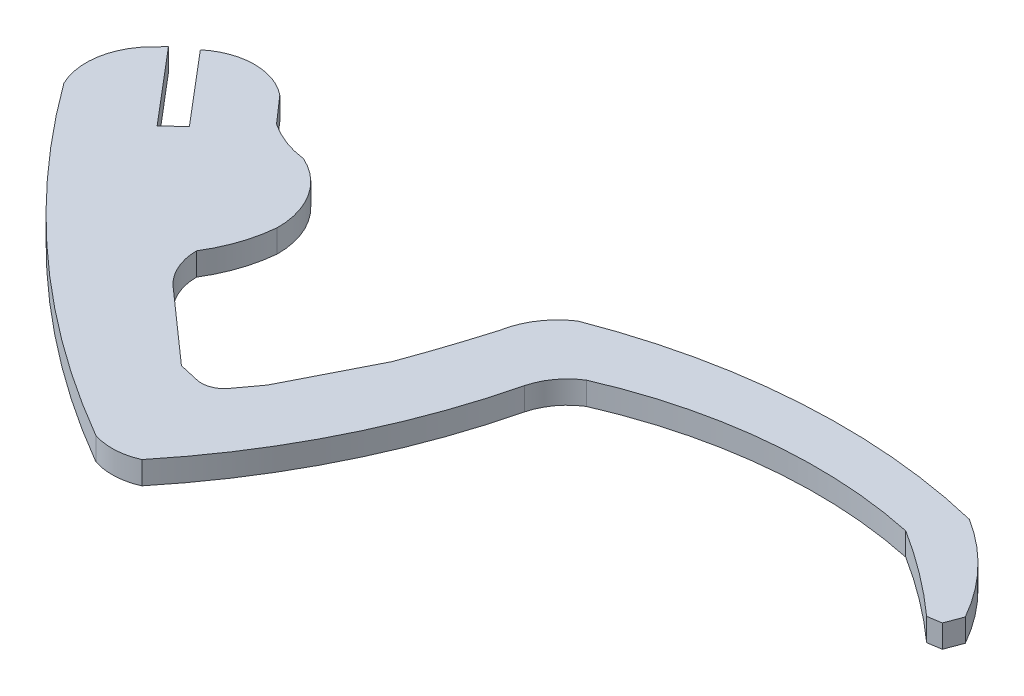
ISO-10303-21;
HEADER;
FILE_DESCRIPTION(('STEP AP214'),'2;1');
FILE_NAME('part.step','',(''),(''),'','','');
FILE_SCHEMA(('AUTOMOTIVE_DESIGN { 1 0 10303 214 1 1 1 1 }'));
ENDSEC;
DATA;
#1=APPLICATION_CONTEXT('core data for automotive mechanical design processes');
#2=APPLICATION_PROTOCOL_DEFINITION('international standard','automotive_design',2000,#1);
#3=PRODUCT_CONTEXT('',#1,'mechanical');
#4=PRODUCT('Part','Part','',(#3));
#5=PRODUCT_RELATED_PRODUCT_CATEGORY('part','',(#4));
#6=PRODUCT_DEFINITION_FORMATION('','',#4);
#7=PRODUCT_DEFINITION_CONTEXT('part definition',#1,'design');
#8=PRODUCT_DEFINITION('design','',#6,#7);
#9=PRODUCT_DEFINITION_SHAPE('','',#8);
#10=(LENGTH_UNIT() NAMED_UNIT(*) SI_UNIT(.MILLI.,.METRE.));
#11=(NAMED_UNIT(*) PLANE_ANGLE_UNIT() SI_UNIT($,.RADIAN.));
#12=(NAMED_UNIT(*) SI_UNIT($,.STERADIAN.) SOLID_ANGLE_UNIT());
#13=UNCERTAINTY_MEASURE_WITH_UNIT(LENGTH_MEASURE(1.E-05),#10,'distance_accuracy_value','');
#14=(GEOMETRIC_REPRESENTATION_CONTEXT(3) GLOBAL_UNCERTAINTY_ASSIGNED_CONTEXT((#13)) GLOBAL_UNIT_ASSIGNED_CONTEXT((#10,
#11,#12)) REPRESENTATION_CONTEXT('',''));
#15=CARTESIAN_POINT('',(0.,0.,0.));
#16=DIRECTION('',(0.,0.,1.));
#17=DIRECTION('',(1.,0.,0.));
#18=AXIS2_PLACEMENT_3D('',#15,#16,#17);
#19=CARTESIAN_POINT('',(-400.996253466817,2.,-450.233849998404));
#20=DIRECTION('',(0.715544191680959,0.,0.698567469720458));
#21=DIRECTION('',(0.698567469720458,0.,-0.715544191680959));
#22=AXIS2_PLACEMENT_3D('',#19,#20,#21);
#23=PLANE('',#22);
#24=DIRECTION('',(-0.698567469720458,0.,0.715544191680959));
#25=VECTOR('',#24,1.);
#26=CARTESIAN_POINT('',(-400.996253466817,0.,-450.233849998404));
#27=LINE('',#26,#25);
#28=CARTESIAN_POINT('',(-289.75829,0.,-564.17514));
#29=VERTEX_POINT('',#28);
#30=CARTESIAN_POINT('',(-290.48127,0.,-563.43459));
#31=VERTEX_POINT('',#30);
#32=EDGE_CURVE('E11',#29,#31,#27,.T.);
#33=ORIENTED_EDGE('',*,*,#32,.T.);
#34=DIRECTION('',(0.,-1.,0.));
#35=VECTOR('',#34,1.);
#36=CARTESIAN_POINT('',(-290.48127,2.,-563.43459));
#37=LINE('',#36,#35);
#38=CARTESIAN_POINT('',(-290.48127,2.,-563.43459));
#39=VERTEX_POINT('',#38);
#40=EDGE_CURVE('E780',#39,#31,#37,.T.);
#41=ORIENTED_EDGE('',*,*,#40,.F.);
#42=DIRECTION('',(-0.698567469720458,0.,0.715544191680959));
#43=VECTOR('',#42,1.);
#44=CARTESIAN_POINT('',(-400.996253466817,2.,-450.233849998404));
#45=LINE('',#44,#43);
#46=CARTESIAN_POINT('',(-289.75829,2.,-564.17514));
#47=VERTEX_POINT('',#46);
#48=EDGE_CURVE('E41',#47,#39,#45,.T.);
#49=ORIENTED_EDGE('',*,*,#48,.F.);
#50=DIRECTION('',(0.,-1.,0.));
#51=VECTOR('',#50,1.);
#52=CARTESIAN_POINT('',(-289.75829,2.,-564.17514));
#53=LINE('',#52,#51);
#54=EDGE_CURVE('E262',#47,#29,#53,.T.);
#55=ORIENTED_EDGE('',*,*,#54,.T.);
#56=EDGE_LOOP('',(#33,#41,#49,#55));
#57=FACE_BOUND('',#56,.T.);
#58=ADVANCED_FACE('F37',(#57),#23,.F.);
#59=CARTESIAN_POINT('',(-286.355311585499,2.,-559.360680308298));
#60=DIRECTION('',(0.,-1.,0.));
#61=DIRECTION('',(0.,0.,-1.));
#62=AXIS2_PLACEMENT_3D('',#59,#60,#61);
#63=CYLINDRICAL_SURFACE('',#62,5.79829914839988);
#64=CARTESIAN_POINT('',(-286.355311585499,0.,-559.360680308298));
#65=DIRECTION('',(0.,1.,0.));
#66=DIRECTION('',(0.,0.,1.));
#67=AXIS2_PLACEMENT_3D('',#64,#65,#66);
#68=CIRCLE('',#67,5.79829914839988);
#69=CARTESIAN_POINT('',(-291.56435000002,0.,-556.813879999993));
#70=VERTEX_POINT('',#69);
#71=EDGE_CURVE('E47',#31,#70,#68,.T.);
#72=ORIENTED_EDGE('',*,*,#71,.T.);
#73=DIRECTION('',(0.,-1.,0.));
#74=VECTOR('',#73,1.);
#75=CARTESIAN_POINT('',(-291.56435000002,2.,-556.813879999993));
#76=LINE('',#75,#74);
#77=CARTESIAN_POINT('',(-291.56435000002,2.,-556.813879999993));
#78=VERTEX_POINT('',#77);
#79=EDGE_CURVE('E237',#78,#70,#76,.T.);
#80=ORIENTED_EDGE('',*,*,#79,.F.);
#81=CARTESIAN_POINT('',(-286.355311585499,2.,-559.360680308298));
#82=DIRECTION('',(0.,1.,0.));
#83=DIRECTION('',(0.,0.,1.));
#84=AXIS2_PLACEMENT_3D('',#81,#82,#83);
#85=CIRCLE('',#84,5.79829914839988);
#86=EDGE_CURVE('E143',#39,#78,#85,.T.);
#87=ORIENTED_EDGE('',*,*,#86,.F.);
#88=ORIENTED_EDGE('',*,*,#40,.T.);
#89=EDGE_LOOP('',(#72,#80,#87,#88));
#90=FACE_BOUND('',#89,.T.);
#91=ADVANCED_FACE('F545',(#90),#63,.T.);
#92=CARTESIAN_POINT('',(-217.488103841831,2.,-610.791634455908));
#93=DIRECTION('',(0.,-1.,0.));
#94=DIRECTION('',(0.,0.,-1.));
#95=AXIS2_PLACEMENT_3D('',#92,#93,#94);
#96=CYLINDRICAL_SURFACE('',#95,91.6563594137998);
#97=CARTESIAN_POINT('',(-217.488103841831,0.,-610.791634455908));
#98=DIRECTION('',(0.,1.,0.));
#99=DIRECTION('',(0.,0.,1.));
#100=AXIS2_PLACEMENT_3D('',#97,#98,#99);
#101=CIRCLE('',#100,91.6563594137998);
#102=CARTESIAN_POINT('',(-263.416080000147,0.,-531.472600000156));
#103=VERTEX_POINT('',#102);
#104=EDGE_CURVE('E231',#70,#103,#101,.T.);
#105=ORIENTED_EDGE('',*,*,#104,.T.);
#106=DIRECTION('',(0.,-1.,0.));
#107=VECTOR('',#106,1.);
#108=CARTESIAN_POINT('',(-263.416080000147,2.,-531.472600000156));
#109=LINE('',#108,#107);
#110=CARTESIAN_POINT('',(-263.416080000147,2.,-531.472600000156));
#111=VERTEX_POINT('',#110);
#112=EDGE_CURVE('E235',#111,#103,#109,.T.);
#113=ORIENTED_EDGE('',*,*,#112,.F.);
#114=CARTESIAN_POINT('',(-217.488103841831,2.,-610.791634455908));
#115=DIRECTION('',(0.,1.,0.));
#116=DIRECTION('',(0.,0.,1.));
#117=AXIS2_PLACEMENT_3D('',#114,#115,#116);
#118=CIRCLE('',#117,91.6563594137998);
#119=EDGE_CURVE('E316',#78,#111,#118,.T.);
#120=ORIENTED_EDGE('',*,*,#119,.F.);
#121=ORIENTED_EDGE('',*,*,#79,.T.);
#122=EDGE_LOOP('',(#105,#113,#120,#121));
#123=FACE_BOUND('',#122,.T.);
#124=ADVANCED_FACE('F233',(#123),#96,.T.);
#125=CARTESIAN_POINT('',(-261.727946177035,2.,-536.490919706104));
#126=DIRECTION('',(0.,-1.,0.));
#127=DIRECTION('',(0.,0.,-1.));
#128=AXIS2_PLACEMENT_3D('',#125,#126,#127);
#129=CYLINDRICAL_SURFACE('',#128,5.29465093050006);
#130=CARTESIAN_POINT('',(-261.727946177035,0.,-536.490919706104));
#131=DIRECTION('',(0.,1.,0.));
#132=DIRECTION('',(0.,0.,1.));
#133=AXIS2_PLACEMENT_3D('',#130,#131,#132);
#134=CIRCLE('',#133,5.29465093050006);
#135=CARTESIAN_POINT('',(-259.570750000054,0.,-531.655650000094));
#136=VERTEX_POINT('',#135);
#137=EDGE_CURVE('E239',#103,#136,#134,.T.);
#138=ORIENTED_EDGE('',*,*,#137,.T.);
#139=DIRECTION('',(0.,-1.,0.));
#140=VECTOR('',#139,1.);
#141=CARTESIAN_POINT('',(-259.570750000054,2.,-531.655650000094));
#142=LINE('',#141,#140);
#143=CARTESIAN_POINT('',(-259.570750000054,2.,-531.655650000094));
#144=VERTEX_POINT('',#143);
#145=EDGE_CURVE('E246',#144,#136,#142,.T.);
#146=ORIENTED_EDGE('',*,*,#145,.F.);
#147=CARTESIAN_POINT('',(-261.727946177035,2.,-536.490919706104));
#148=DIRECTION('',(0.,1.,0.));
#149=DIRECTION('',(0.,0.,1.));
#150=AXIS2_PLACEMENT_3D('',#147,#148,#149);
#151=CIRCLE('',#150,5.29465093050006);
#152=EDGE_CURVE('E245',#111,#144,#151,.T.);
#153=ORIENTED_EDGE('',*,*,#152,.F.);
#154=ORIENTED_EDGE('',*,*,#112,.T.);
#155=EDGE_LOOP('',(#138,#146,#153,#154));
#156=FACE_BOUND('',#155,.T.);
#157=ADVANCED_FACE('F242',(#156),#129,.T.);
#158=CARTESIAN_POINT('',(-303.034570550587,2.,-567.301598895275));
#159=DIRECTION('',(0.,-1.,0.));
#160=DIRECTION('',(0.,0.,-1.));
#161=AXIS2_PLACEMENT_3D('',#158,#159,#160);
#162=CYLINDRICAL_SURFACE('',#161,56.2115412481);
#163=CARTESIAN_POINT('',(-303.034570550587,0.,-567.301598895275));
#164=DIRECTION('',(0.,1.,0.));
#165=DIRECTION('',(0.,0.,1.));
#166=AXIS2_PLACEMENT_3D('',#163,#164,#165);
#167=CIRCLE('',#166,56.2115412481);
#168=CARTESIAN_POINT('',(-248.40263000008,0.,-554.069500000064));
#169=VERTEX_POINT('',#168);
#170=EDGE_CURVE('E252',#136,#169,#167,.T.);
#171=ORIENTED_EDGE('',*,*,#170,.T.);
#172=DIRECTION('',(0.,-1.,0.));
#173=VECTOR('',#172,1.);
#174=CARTESIAN_POINT('',(-248.40263000008,2.,-554.069500000064));
#175=LINE('',#174,#173);
#176=CARTESIAN_POINT('',(-248.40263000008,2.,-554.069500000064));
#177=VERTEX_POINT('',#176);
#178=EDGE_CURVE('E381',#177,#169,#175,.T.);
#179=ORIENTED_EDGE('',*,*,#178,.F.);
#180=CARTESIAN_POINT('',(-303.034570550587,2.,-567.301598895275));
#181=DIRECTION('',(0.,1.,0.));
#182=DIRECTION('',(0.,0.,1.));
#183=AXIS2_PLACEMENT_3D('',#180,#181,#182);
#184=CIRCLE('',#183,56.2115412481);
#185=EDGE_CURVE('E313',#144,#177,#184,.T.);
#186=ORIENTED_EDGE('',*,*,#185,.F.);
#187=ORIENTED_EDGE('',*,*,#145,.T.);
#188=EDGE_LOOP('',(#171,#179,#186,#187));
#189=FACE_BOUND('',#188,.T.);
#190=ADVANCED_FACE('F385',(#189),#162,.T.);
#191=CARTESIAN_POINT('',(-243.300872370782,2.,-552.712976777928));
#192=DIRECTION('',(0.,-1.,0.));
#193=DIRECTION('',(0.,0.,-1.));
#194=AXIS2_PLACEMENT_3D('',#191,#192,#193);
#195=CYLINDRICAL_SURFACE('',#194,5.27902322028303);
#196=CARTESIAN_POINT('',(-243.300872370782,0.,-552.712976777928));
#197=DIRECTION('',(0.,1.,0.));
#198=DIRECTION('',(0.,0.,1.));
#199=AXIS2_PLACEMENT_3D('',#196,#197,#198);
#200=CIRCLE('',#199,5.27902322028303);
#201=CARTESIAN_POINT('',(-246.114050000039,0.,-557.17998000006));
#202=VERTEX_POINT('',#201);
#203=EDGE_CURVE('E254',#202,#169,#200,.T.);
#204=ORIENTED_EDGE('',*,*,#203,.F.);
#205=DIRECTION('',(0.,-1.,0.));
#206=VECTOR('',#205,1.);
#207=CARTESIAN_POINT('',(-246.114050000039,2.,-557.17998000006));
#208=LINE('',#207,#206);
#209=CARTESIAN_POINT('',(-246.114050000039,2.,-557.17998000006));
#210=VERTEX_POINT('',#209);
#211=EDGE_CURVE('E378',#210,#202,#208,.T.);
#212=ORIENTED_EDGE('',*,*,#211,.F.);
#213=CARTESIAN_POINT('',(-243.300872370782,2.,-552.712976777928));
#214=DIRECTION('',(0.,1.,0.));
#215=DIRECTION('',(0.,0.,1.));
#216=AXIS2_PLACEMENT_3D('',#213,#214,#215);
#217=CIRCLE('',#216,5.27902322028303);
#218=EDGE_CURVE('E310',#210,#177,#217,.T.);
#219=ORIENTED_EDGE('',*,*,#218,.T.);
#220=ORIENTED_EDGE('',*,*,#178,.T.);
#221=EDGE_LOOP('',(#204,#212,#219,#220));
#222=FACE_BOUND('',#221,.T.);
#223=ADVANCED_FACE('F377',(#222),#195,.F.);
#224=CARTESIAN_POINT('',(-229.38232268988,2.,-518.653359729311));
#225=DIRECTION('',(0.,-1.,0.));
#226=DIRECTION('',(0.,0.,-1.));
#227=AXIS2_PLACEMENT_3D('',#224,#225,#226);
#228=CYLINDRICAL_SURFACE('',#227,42.0029899919999);
#229=CARTESIAN_POINT('',(-229.38232268988,0.,-518.653359729311));
#230=DIRECTION('',(0.,1.,0.));
#231=DIRECTION('',(0.,0.,1.));
#232=AXIS2_PLACEMENT_3D('',#229,#230,#231);
#233=CIRCLE('',#232,42.0029899919999);
#234=CARTESIAN_POINT('',(-220.664320000084,0.,-559.741650000004));
#235=VERTEX_POINT('',#234);
#236=EDGE_CURVE('E372',#235,#202,#233,.T.);
#237=ORIENTED_EDGE('',*,*,#236,.F.);
#238=DIRECTION('',(0.,-1.,0.));
#239=VECTOR('',#238,1.);
#240=CARTESIAN_POINT('',(-220.664320000084,2.,-559.741650000004));
#241=LINE('',#240,#239);
#242=CARTESIAN_POINT('',(-220.664320000084,2.,-559.741650000004));
#243=VERTEX_POINT('',#242);
#244=EDGE_CURVE('E390',#243,#235,#241,.T.);
#245=ORIENTED_EDGE('',*,*,#244,.F.);
#246=CARTESIAN_POINT('',(-229.38232268988,2.,-518.653359729311));
#247=DIRECTION('',(0.,1.,0.));
#248=DIRECTION('',(0.,0.,1.));
#249=AXIS2_PLACEMENT_3D('',#246,#247,#248);
#250=CIRCLE('',#249,42.0029899919999);
#251=EDGE_CURVE('E307',#243,#210,#250,.T.);
#252=ORIENTED_EDGE('',*,*,#251,.T.);
#253=ORIENTED_EDGE('',*,*,#211,.T.);
#254=EDGE_LOOP('',(#237,#245,#252,#253));
#255=FACE_BOUND('',#254,.T.);
#256=ADVANCED_FACE('F534',(#255),#228,.F.);
#257=CARTESIAN_POINT('',(-250.09596956146,2.,-512.918382143863));
#258=DIRECTION('',(0.,-1.,0.));
#259=DIRECTION('',(0.,0.,-1.));
#260=AXIS2_PLACEMENT_3D('',#257,#258,#259);
#261=CYLINDRICAL_SURFACE('',#260,55.304976346);
#262=CARTESIAN_POINT('',(-250.09596956146,0.,-512.918382143863));
#263=DIRECTION('',(0.,1.,0.));
#264=DIRECTION('',(0.,0.,1.));
#265=AXIS2_PLACEMENT_3D('',#262,#263,#264);
#266=CIRCLE('',#265,55.304976346);
#267=CARTESIAN_POINT('',(-213.249010000091,0.,-554.160860000006));
#268=VERTEX_POINT('',#267);
#269=EDGE_CURVE('E369',#268,#235,#266,.T.);
#270=ORIENTED_EDGE('',*,*,#269,.F.);
#271=DIRECTION('',(0.,-1.,0.));
#272=VECTOR('',#271,1.);
#273=CARTESIAN_POINT('',(-213.249010000091,2.,-554.160860000006));
#274=LINE('',#273,#272);
#275=CARTESIAN_POINT('',(-213.249010000091,2.,-554.160860000006));
#276=VERTEX_POINT('',#275);
#277=EDGE_CURVE('E392',#276,#268,#274,.T.);
#278=ORIENTED_EDGE('',*,*,#277,.F.);
#279=CARTESIAN_POINT('',(-250.09596956146,2.,-512.918382143863));
#280=DIRECTION('',(0.,1.,0.));
#281=DIRECTION('',(0.,0.,1.));
#282=AXIS2_PLACEMENT_3D('',#279,#280,#281);
#283=CIRCLE('',#282,55.304976346);
#284=EDGE_CURVE('E304',#276,#243,#283,.T.);
#285=ORIENTED_EDGE('',*,*,#284,.T.);
#286=ORIENTED_EDGE('',*,*,#244,.T.);
#287=EDGE_LOOP('',(#270,#278,#285,#286));
#288=FACE_BOUND('',#287,.T.);
#289=ADVANCED_FACE('F529',(#288),#261,.F.);
#290=CARTESIAN_POINT('',(-515.941175159313,2.,-507.599682816693));
#291=DIRECTION('',(-0.152035339859567,0.,-0.988375058079566));
#292=DIRECTION('',(-0.988375058079566,0.,0.152035339859567));
#293=AXIS2_PLACEMENT_3D('',#290,#291,#292);
#294=PLANE('',#293);
#295=DIRECTION('',(0.988375058079566,0.,-0.152035339859567));
#296=VECTOR('',#295,1.);
#297=CARTESIAN_POINT('',(-515.941175159313,0.,-507.599682816693));
#298=LINE('',#297,#296);
#299=CARTESIAN_POINT('',(-212.05901000006,0.,-554.343910000063));
#300=VERTEX_POINT('',#299);
#301=EDGE_CURVE('E367',#268,#300,#298,.T.);
#302=ORIENTED_EDGE('',*,*,#301,.T.);
#303=DIRECTION('',(0.,-1.,0.));
#304=VECTOR('',#303,1.);
#305=CARTESIAN_POINT('',(-212.05901000006,2.,-554.343910000063));
#306=LINE('',#305,#304);
#307=CARTESIAN_POINT('',(-212.05901000006,2.,-554.343910000063));
#308=VERTEX_POINT('',#307);
#309=EDGE_CURVE('E394',#308,#300,#306,.T.);
#310=ORIENTED_EDGE('',*,*,#309,.F.);
#311=DIRECTION('',(0.988375058079566,0.,-0.152035339859567));
#312=VECTOR('',#311,1.);
#313=CARTESIAN_POINT('',(-515.941175159313,2.,-507.599682816693));
#314=LINE('',#313,#312);
#315=EDGE_CURVE('E302',#276,#308,#314,.T.);
#316=ORIENTED_EDGE('',*,*,#315,.F.);
#317=ORIENTED_EDGE('',*,*,#277,.T.);
#318=EDGE_LOOP('',(#302,#310,#316,#317));
#319=FACE_BOUND('',#318,.T.);
#320=ADVANCED_FACE('F535',(#319),#294,.F.);
#321=CARTESIAN_POINT('',(-244.974182067156,2.,-466.678523413584));
#322=DIRECTION('',(-0.936186373423325,0.,-0.351504017354686));
#323=DIRECTION('',(-0.351504017354686,0.,0.936186373423325));
#324=AXIS2_PLACEMENT_3D('',#321,#322,#323);
#325=PLANE('',#324);
#326=DIRECTION('',(0.351504017354686,0.,-0.936186373423325));
#327=VECTOR('',#326,1.);
#328=CARTESIAN_POINT('',(-244.974182067156,0.,-466.678523413584));
#329=LINE('',#328,#327);
#330=CARTESIAN_POINT('',(-211.50944000006,0.,-555.807620000063));
#331=VERTEX_POINT('',#330);
#332=EDGE_CURVE('E365',#300,#331,#329,.T.);
#333=ORIENTED_EDGE('',*,*,#332,.T.);
#334=DIRECTION('',(0.,-1.,0.));
#335=VECTOR('',#334,1.);
#336=CARTESIAN_POINT('',(-211.50944000006,2.,-555.807620000063));
#337=LINE('',#336,#335);
#338=CARTESIAN_POINT('',(-211.50944000006,2.,-555.807620000063));
#339=VERTEX_POINT('',#338);
#340=EDGE_CURVE('E397',#339,#331,#337,.T.);
#341=ORIENTED_EDGE('',*,*,#340,.F.);
#342=DIRECTION('',(0.351504017354686,0.,-0.936186373423325));
#343=VECTOR('',#342,1.);
#344=CARTESIAN_POINT('',(-244.974182067156,2.,-466.678523413584));
#345=LINE('',#344,#343);
#346=EDGE_CURVE('E300',#308,#339,#345,.T.);
#347=ORIENTED_EDGE('',*,*,#346,.F.);
#348=ORIENTED_EDGE('',*,*,#309,.T.);
#349=EDGE_LOOP('',(#333,#341,#347,#348));
#350=FACE_BOUND('',#349,.T.);
#351=ADVANCED_FACE('F523',(#350),#325,.F.);
#352=CARTESIAN_POINT('',(-230.03266773464,2.,-545.405668120513));
#353=DIRECTION('',(0.,-1.,0.));
#354=DIRECTION('',(0.,0.,-1.));
#355=AXIS2_PLACEMENT_3D('',#352,#353,#354);
#356=CYLINDRICAL_SURFACE('',#355,21.2440713756);
#357=CARTESIAN_POINT('',(-230.03266773464,0.,-545.405668120513));
#358=DIRECTION('',(0.,1.,0.));
#359=DIRECTION('',(0.,0.,1.));
#360=AXIS2_PLACEMENT_3D('',#357,#358,#359);
#361=CIRCLE('',#360,21.2440713756);
#362=CARTESIAN_POINT('',(-218.741930000036,0.,-563.400940000092));
#363=VERTEX_POINT('',#362);
#364=EDGE_CURVE('E363',#331,#363,#361,.T.);
#365=ORIENTED_EDGE('',*,*,#364,.T.);
#366=DIRECTION('',(0.,-1.,0.));
#367=VECTOR('',#366,1.);
#368=CARTESIAN_POINT('',(-218.741930000036,2.,-563.400940000092));
#369=LINE('',#368,#367);
#370=CARTESIAN_POINT('',(-218.741930000036,2.,-563.400940000092));
#371=VERTEX_POINT('',#370);
#372=EDGE_CURVE('E400',#371,#363,#369,.T.);
#373=ORIENTED_EDGE('',*,*,#372,.F.);
#374=CARTESIAN_POINT('',(-230.03266773464,2.,-545.405668120513));
#375=DIRECTION('',(0.,1.,0.));
#376=DIRECTION('',(0.,0.,1.));
#377=AXIS2_PLACEMENT_3D('',#374,#375,#376);
#378=CIRCLE('',#377,21.2440713756);
#379=EDGE_CURVE('E298',#339,#371,#378,.T.);
#380=ORIENTED_EDGE('',*,*,#379,.F.);
#381=ORIENTED_EDGE('',*,*,#340,.T.);
#382=EDGE_LOOP('',(#365,#373,#380,#381));
#383=FACE_BOUND('',#382,.T.);
#384=ADVANCED_FACE('F519',(#383),#356,.T.);
#385=CARTESIAN_POINT('',(-231.495738656652,2.,-510.920880087766));
#386=DIRECTION('',(0.,-1.,0.));
#387=DIRECTION('',(0.,0.,-1.));
#388=AXIS2_PLACEMENT_3D('',#385,#386,#387);
#389=CYLINDRICAL_SURFACE('',#388,54.0075580234001);
#390=CARTESIAN_POINT('',(-231.495738656652,0.,-510.920880087766));
#391=DIRECTION('',(0.,1.,0.));
#392=DIRECTION('',(0.,0.,1.));
#393=AXIS2_PLACEMENT_3D('',#390,#391,#392);
#394=CIRCLE('',#393,54.0075580234001);
#395=CARTESIAN_POINT('',(-250.966000000073,0.,-561.296720000067));
#396=VERTEX_POINT('',#395);
#397=EDGE_CURVE('E361',#363,#396,#394,.T.);
#398=ORIENTED_EDGE('',*,*,#397,.T.);
#399=DIRECTION('',(0.,-1.,0.));
#400=VECTOR('',#399,1.);
#401=CARTESIAN_POINT('',(-250.966000000073,2.,-561.296720000067));
#402=LINE('',#401,#400);
#403=CARTESIAN_POINT('',(-250.966000000073,2.,-561.296720000067));
#404=VERTEX_POINT('',#403);
#405=EDGE_CURVE('E403',#404,#396,#402,.T.);
#406=ORIENTED_EDGE('',*,*,#405,.F.);
#407=CARTESIAN_POINT('',(-231.495738656652,2.,-510.920880087766));
#408=DIRECTION('',(0.,1.,0.));
#409=DIRECTION('',(0.,0.,1.));
#410=AXIS2_PLACEMENT_3D('',#407,#408,#409);
#411=CIRCLE('',#410,54.0075580234001);
#412=EDGE_CURVE('E296',#371,#404,#411,.T.);
#413=ORIENTED_EDGE('',*,*,#412,.F.);
#414=ORIENTED_EDGE('',*,*,#372,.T.);
#415=EDGE_LOOP('',(#398,#406,#413,#414));
#416=FACE_BOUND('',#415,.T.);
#417=ADVANCED_FACE('F514',(#416),#389,.T.);
#418=CARTESIAN_POINT('',(-247.503089617452,2.,-556.04589058121));
#419=DIRECTION('',(0.,-1.,0.));
#420=DIRECTION('',(0.,0.,-1.));
#421=AXIS2_PLACEMENT_3D('',#418,#419,#420);
#422=CYLINDRICAL_SURFACE('',#421,6.28990921270002);
#423=CARTESIAN_POINT('',(-247.503089617452,0.,-556.04589058121));
#424=DIRECTION('',(0.,1.,0.));
#425=DIRECTION('',(0.,0.,1.));
#426=AXIS2_PLACEMENT_3D('',#423,#424,#425);
#427=CIRCLE('',#426,6.28990921270002);
#428=CARTESIAN_POINT('',(-253.695010000061,0.,-557.151820000042));
#429=VERTEX_POINT('',#428);
#430=EDGE_CURVE('E358',#396,#429,#427,.T.);
#431=ORIENTED_EDGE('',*,*,#430,.T.);
#432=DIRECTION('',(0.,-1.,0.));
#433=VECTOR('',#432,1.);
#434=CARTESIAN_POINT('',(-253.695010000061,2.,-557.151820000042));
#435=LINE('',#434,#433);
#436=CARTESIAN_POINT('',(-253.695010000061,2.,-557.151820000042));
#437=VERTEX_POINT('',#436);
#438=EDGE_CURVE('E406',#437,#429,#435,.T.);
#439=ORIENTED_EDGE('',*,*,#438,.F.);
#440=CARTESIAN_POINT('',(-247.503089617452,2.,-556.04589058121));
#441=DIRECTION('',(0.,1.,0.));
#442=DIRECTION('',(0.,0.,1.));
#443=AXIS2_PLACEMENT_3D('',#440,#441,#442);
#444=CIRCLE('',#443,6.28990921270002);
#445=EDGE_CURVE('E294',#404,#437,#444,.T.);
#446=ORIENTED_EDGE('',*,*,#445,.F.);
#447=ORIENTED_EDGE('',*,*,#405,.T.);
#448=EDGE_LOOP('',(#431,#439,#446,#447));
#449=FACE_BOUND('',#448,.T.);
#450=ADVANCED_FACE('F508',(#449),#422,.T.);
#451=CARTESIAN_POINT('',(-360.133290719522,2.,-588.362316933152));
#452=DIRECTION('',(0.,-1.,0.));
#453=DIRECTION('',(0.,0.,-1.));
#454=AXIS2_PLACEMENT_3D('',#451,#452,#453);
#455=CYLINDRICAL_SURFACE('',#454,110.919803107139);
#456=CARTESIAN_POINT('',(-360.133290719522,0.,-588.362316933152));
#457=DIRECTION('',(0.,1.,0.));
#458=DIRECTION('',(0.,0.,1.));
#459=AXIS2_PLACEMENT_3D('',#456,#457,#458);
#460=CIRCLE('',#459,110.919803107139);
#461=CARTESIAN_POINT('',(-256.030120000033,0.,-550.077430000116));
#462=VERTEX_POINT('',#461);
#463=EDGE_CURVE('E355',#462,#429,#460,.T.);
#464=ORIENTED_EDGE('',*,*,#463,.F.);
#465=DIRECTION('',(0.,-1.,0.));
#466=VECTOR('',#465,1.);
#467=CARTESIAN_POINT('',(-256.030120000033,2.,-550.077430000116));
#468=LINE('',#467,#466);
#469=CARTESIAN_POINT('',(-256.030120000033,2.,-550.077430000116));
#470=VERTEX_POINT('',#469);
#471=EDGE_CURVE('E408',#470,#462,#468,.T.);
#472=ORIENTED_EDGE('',*,*,#471,.F.);
#473=CARTESIAN_POINT('',(-360.133290719522,2.,-588.362316933152));
#474=DIRECTION('',(0.,1.,0.));
#475=DIRECTION('',(0.,0.,1.));
#476=AXIS2_PLACEMENT_3D('',#473,#474,#475);
#477=CIRCLE('',#476,110.919803107139);
#478=EDGE_CURVE('E291',#470,#437,#477,.T.);
#479=ORIENTED_EDGE('',*,*,#478,.T.);
#480=ORIENTED_EDGE('',*,*,#438,.T.);
#481=EDGE_LOOP('',(#464,#472,#479,#480));
#482=FACE_BOUND('',#481,.T.);
#483=ADVANCED_FACE('F502',(#482),#455,.F.);
#484=CARTESIAN_POINT('',(-302.512848069389,2.,-458.622108733944));
#485=DIRECTION('',(0.891463792247105,0.,0.453091941124988));
#486=DIRECTION('',(0.453091941124988,0.,-0.891463792247105));
#487=AXIS2_PLACEMENT_3D('',#484,#485,#486);
#488=PLANE('',#487);
#489=DIRECTION('',(-0.453091941124988,0.,0.891463792247105));
#490=VECTOR('',#489,1.);
#491=CARTESIAN_POINT('',(-302.512848069389,0.,-458.622108733944));
#492=LINE('',#491,#490);
#493=CARTESIAN_POINT('',(-259.717009999986,0.,-542.823430000038));
#494=VERTEX_POINT('',#493);
#495=EDGE_CURVE('E353',#462,#494,#492,.T.);
#496=ORIENTED_EDGE('',*,*,#495,.T.);
#497=DIRECTION('',(0.,-1.,0.));
#498=VECTOR('',#497,1.);
#499=CARTESIAN_POINT('',(-259.717009999986,2.,-542.823430000038));
#500=LINE('',#499,#498);
#501=CARTESIAN_POINT('',(-259.717009999986,2.,-542.823430000038));
#502=VERTEX_POINT('',#501);
#503=EDGE_CURVE('E410',#502,#494,#500,.T.);
#504=ORIENTED_EDGE('',*,*,#503,.F.);
#505=DIRECTION('',(-0.453091941124988,0.,0.891463792247105));
#506=VECTOR('',#505,1.);
#507=CARTESIAN_POINT('',(-302.512848069389,2.,-458.622108733944));
#508=LINE('',#507,#506);
#509=EDGE_CURVE('E289',#470,#502,#508,.T.);
#510=ORIENTED_EDGE('',*,*,#509,.F.);
#511=ORIENTED_EDGE('',*,*,#471,.T.);
#512=EDGE_LOOP('',(#496,#504,#510,#511));
#513=FACE_BOUND('',#512,.T.);
#514=ADVANCED_FACE('F615',(#513),#488,.F.);
#515=CARTESIAN_POINT('',(-339.4438362699,2.,-434.691200177255));
#516=DIRECTION('',(0.804876479755135,0.,0.59344237490845));
#517=DIRECTION('',(0.59344237490845,0.,-0.804876479755135));
#518=AXIS2_PLACEMENT_3D('',#515,#516,#517);
#519=PLANE('',#518);
#520=DIRECTION('',(-0.59344237490845,0.,0.804876479755135));
#521=VECTOR('',#520,1.);
#522=CARTESIAN_POINT('',(-339.4438362699,0.,-434.691200177255));
#523=LINE('',#522,#521);
#524=CARTESIAN_POINT('',(-261.146880000002,0.,-540.884119999975));
#525=VERTEX_POINT('',#524);
#526=EDGE_CURVE('E350',#494,#525,#523,.T.);
#527=ORIENTED_EDGE('',*,*,#526,.T.);
#528=DIRECTION('',(0.,-1.,0.));
#529=VECTOR('',#528,1.);
#530=CARTESIAN_POINT('',(-261.146880000002,2.,-540.884119999975));
#531=LINE('',#530,#529);
#532=CARTESIAN_POINT('',(-261.146880000002,2.,-540.884119999975));
#533=VERTEX_POINT('',#532);
#534=EDGE_CURVE('E413',#533,#525,#531,.T.);
#535=ORIENTED_EDGE('',*,*,#534,.F.);
#536=DIRECTION('',(-0.59344237490845,0.,0.804876479755135));
#537=VECTOR('',#536,1.);
#538=CARTESIAN_POINT('',(-339.4438362699,2.,-434.691200177255));
#539=LINE('',#538,#537);
#540=EDGE_CURVE('E287',#502,#533,#539,.T.);
#541=ORIENTED_EDGE('',*,*,#540,.F.);
#542=ORIENTED_EDGE('',*,*,#503,.T.);
#543=EDGE_LOOP('',(#527,#535,#541,#542));
#544=FACE_BOUND('',#543,.T.);
#545=ADVANCED_FACE('F495',(#544),#519,.F.);
#546=CARTESIAN_POINT('',(-262.756630279785,2.,-542.071009895938));
#547=DIRECTION('',(0.,-1.,0.));
#548=DIRECTION('',(0.,0.,-1.));
#549=AXIS2_PLACEMENT_3D('',#546,#547,#548);
#550=CYLINDRICAL_SURFACE('',#549,2.00000089710008);
#551=CARTESIAN_POINT('',(-262.756630279785,0.,-542.071009895938));
#552=DIRECTION('',(0.,1.,0.));
#553=DIRECTION('',(0.,0.,1.));
#554=AXIS2_PLACEMENT_3D('',#551,#552,#553);
#555=CIRCLE('',#554,2.00000089710008);
#556=CARTESIAN_POINT('',(-263.199550000028,0.,-540.120669999966));
#557=VERTEX_POINT('',#556);
#558=EDGE_CURVE('E347',#557,#525,#555,.T.);
#559=ORIENTED_EDGE('',*,*,#558,.F.);
#560=DIRECTION('',(0.,-1.,0.));
#561=VECTOR('',#560,1.);
#562=CARTESIAN_POINT('',(-263.199550000028,2.,-540.120669999966));
#563=LINE('',#562,#561);
#564=CARTESIAN_POINT('',(-263.199550000028,2.,-540.120669999966));
#565=VERTEX_POINT('',#564);
#566=EDGE_CURVE('E415',#565,#557,#563,.T.);
#567=ORIENTED_EDGE('',*,*,#566,.F.);
#568=CARTESIAN_POINT('',(-262.756630279785,2.,-542.071009895938));
#569=DIRECTION('',(0.,1.,0.));
#570=DIRECTION('',(0.,0.,1.));
#571=AXIS2_PLACEMENT_3D('',#568,#569,#570);
#572=CIRCLE('',#571,2.00000089710008);
#573=EDGE_CURVE('E284',#565,#533,#572,.T.);
#574=ORIENTED_EDGE('',*,*,#573,.T.);
#575=ORIENTED_EDGE('',*,*,#534,.T.);
#576=EDGE_LOOP('',(#559,#567,#574,#575));
#577=FACE_BOUND('',#576,.T.);
#578=ADVANCED_FACE('F489',(#577),#550,.F.);
#579=CARTESIAN_POINT('',(-519.902970123435,2.,-598.418135303448));
#580=DIRECTION('',(-0.221461363697012,0.,0.975169146553284));
#581=DIRECTION('',(0.975169146553284,0.,0.221461363697012));
#582=AXIS2_PLACEMENT_3D('',#579,#580,#581);
#583=PLANE('',#582);
#584=DIRECTION('',(-0.975169146553284,0.,-0.221461363697012));
#585=VECTOR('',#584,1.);
#586=CARTESIAN_POINT('',(-519.902970123435,0.,-598.418135303448));
#587=LINE('',#586,#585);
#588=CARTESIAN_POINT('',(-264.959519999986,0.,-540.520360000038));
#589=VERTEX_POINT('',#588);
#590=EDGE_CURVE('E345',#557,#589,#587,.T.);
#591=ORIENTED_EDGE('',*,*,#590,.T.);
#592=DIRECTION('',(0.,-1.,0.));
#593=VECTOR('',#592,1.);
#594=CARTESIAN_POINT('',(-264.959519999986,2.,-540.520360000038));
#595=LINE('',#594,#593);
#596=CARTESIAN_POINT('',(-264.959519999986,2.,-540.520360000038));
#597=VERTEX_POINT('',#596);
#598=EDGE_CURVE('E417',#597,#589,#595,.T.);
#599=ORIENTED_EDGE('',*,*,#598,.F.);
#600=DIRECTION('',(-0.975169146553284,0.,-0.221461363697012));
#601=VECTOR('',#600,1.);
#602=CARTESIAN_POINT('',(-519.902970123435,2.,-598.418135303448));
#603=LINE('',#602,#601);
#604=EDGE_CURVE('E282',#565,#597,#603,.T.);
#605=ORIENTED_EDGE('',*,*,#604,.F.);
#606=ORIENTED_EDGE('',*,*,#566,.T.);
#607=EDGE_LOOP('',(#591,#599,#605,#606));
#608=FACE_BOUND('',#607,.T.);
#609=ADVANCED_FACE('F640',(#608),#583,.F.);
#610=CARTESIAN_POINT('',(-426.91109145732,2.,-683.911967561243));
#611=DIRECTION('',(-0.662902559292322,0.,0.748705681081484));
#612=DIRECTION('',(0.748705681081484,0.,0.662902559292322));
#613=AXIS2_PLACEMENT_3D('',#610,#611,#612);
#614=PLANE('',#613);
#615=DIRECTION('',(-0.748705681081484,0.,-0.662902559292322));
#616=VECTOR('',#615,1.);
#617=CARTESIAN_POINT('',(-426.91109145732,0.,-683.911967561243));
#618=LINE('',#617,#616);
#619=CARTESIAN_POINT('',(-271.527209999991,0.,-546.335380000091));
#620=VERTEX_POINT('',#619);
#621=EDGE_CURVE('E342',#589,#620,#618,.T.);
#622=ORIENTED_EDGE('',*,*,#621,.T.);
#623=DIRECTION('',(0.,-1.,0.));
#624=VECTOR('',#623,1.);
#625=CARTESIAN_POINT('',(-271.527209999991,2.,-546.335380000091));
#626=LINE('',#625,#624);
#627=CARTESIAN_POINT('',(-271.527209999991,2.,-546.335380000091));
#628=VERTEX_POINT('',#627);
#629=EDGE_CURVE('E420',#628,#620,#626,.T.);
#630=ORIENTED_EDGE('',*,*,#629,.F.);
#631=DIRECTION('',(-0.748705681081484,0.,-0.662902559292322));
#632=VECTOR('',#631,1.);
#633=CARTESIAN_POINT('',(-426.91109145732,2.,-683.911967561243));
#634=LINE('',#633,#632);
#635=EDGE_CURVE('E280',#597,#628,#634,.T.);
#636=ORIENTED_EDGE('',*,*,#635,.F.);
#637=ORIENTED_EDGE('',*,*,#598,.T.);
#638=EDGE_LOOP('',(#622,#630,#636,#637));
#639=FACE_BOUND('',#638,.T.);
#640=ADVANCED_FACE('F482',(#639),#614,.F.);
#641=CARTESIAN_POINT('',(-267.833049826986,2.,-549.984809587838));
#642=DIRECTION('',(0.,-1.,0.));
#643=DIRECTION('',(0.,0.,-1.));
#644=AXIS2_PLACEMENT_3D('',#641,#642,#643);
#645=CYLINDRICAL_SURFACE('',#644,5.19279844590004);
#646=CARTESIAN_POINT('',(-267.833049826986,0.,-549.984809587838));
#647=DIRECTION('',(0.,1.,0.));
#648=DIRECTION('',(0.,0.,1.));
#649=AXIS2_PLACEMENT_3D('',#646,#647,#648);
#650=CIRCLE('',#649,5.19279844590004);
#651=CARTESIAN_POINT('',(-273.025229999987,0.,-549.904680000077));
#652=VERTEX_POINT('',#651);
#653=EDGE_CURVE('E339',#652,#620,#650,.T.);
#654=ORIENTED_EDGE('',*,*,#653,.F.);
#655=DIRECTION('',(0.,-1.,0.));
#656=VECTOR('',#655,1.);
#657=CARTESIAN_POINT('',(-273.025229999987,2.,-549.904680000077));
#658=LINE('',#657,#656);
#659=CARTESIAN_POINT('',(-273.025229999987,2.,-549.904680000077));
#660=VERTEX_POINT('',#659);
#661=EDGE_CURVE('E422',#660,#652,#658,.T.);
#662=ORIENTED_EDGE('',*,*,#661,.F.);
#663=CARTESIAN_POINT('',(-267.833049826986,2.,-549.984809587838));
#664=DIRECTION('',(0.,1.,0.));
#665=DIRECTION('',(0.,0.,1.));
#666=AXIS2_PLACEMENT_3D('',#663,#664,#665);
#667=CIRCLE('',#666,5.19279844590004);
#668=EDGE_CURVE('E277',#660,#628,#667,.T.);
#669=ORIENTED_EDGE('',*,*,#668,.T.);
#670=ORIENTED_EDGE('',*,*,#629,.T.);
#671=EDGE_LOOP('',(#654,#662,#669,#670));
#672=FACE_BOUND('',#671,.T.);
#673=ADVANCED_FACE('F476',(#672),#645,.F.);
#674=CARTESIAN_POINT('',(-283.31940150119,2.,-556.325455548095));
#675=DIRECTION('',(0.,-1.,0.));
#676=DIRECTION('',(0.,0.,-1.));
#677=AXIS2_PLACEMENT_3D('',#674,#675,#676);
#678=CYLINDRICAL_SURFACE('',#677,12.1324492801);
#679=CARTESIAN_POINT('',(-283.31940150119,0.,-556.325455548095));
#680=DIRECTION('',(0.,1.,0.));
#681=DIRECTION('',(0.,0.,1.));
#682=AXIS2_PLACEMENT_3D('',#679,#680,#681);
#683=CIRCLE('',#682,12.1324492801);
#684=CARTESIAN_POINT('',(-271.23913000001,0.,-555.201460000063));
#685=VERTEX_POINT('',#684);
#686=EDGE_CURVE('E337',#652,#685,#683,.T.);
#687=ORIENTED_EDGE('',*,*,#686,.T.);
#688=DIRECTION('',(0.,-1.,0.));
#689=VECTOR('',#688,1.);
#690=CARTESIAN_POINT('',(-271.23913000001,2.,-555.201460000063));
#691=LINE('',#690,#689);
#692=CARTESIAN_POINT('',(-271.23913000001,2.,-555.201460000063));
#693=VERTEX_POINT('',#692);
#694=EDGE_CURVE('E424',#693,#685,#691,.T.);
#695=ORIENTED_EDGE('',*,*,#694,.F.);
#696=CARTESIAN_POINT('',(-283.31940150119,2.,-556.325455548095));
#697=DIRECTION('',(0.,1.,0.));
#698=DIRECTION('',(0.,0.,1.));
#699=AXIS2_PLACEMENT_3D('',#696,#697,#698);
#700=CIRCLE('',#699,12.1324492801);
#701=EDGE_CURVE('E275',#660,#693,#700,.T.);
#702=ORIENTED_EDGE('',*,*,#701,.F.);
#703=ORIENTED_EDGE('',*,*,#661,.T.);
#704=EDGE_LOOP('',(#687,#695,#702,#703));
#705=FACE_BOUND('',#704,.T.);
#706=ADVANCED_FACE('F665',(#705),#678,.T.);
#707=CARTESIAN_POINT('',(-278.168477641643,2.,-555.270686315264));
#708=DIRECTION('',(0.,-1.,0.));
#709=DIRECTION('',(0.,0.,-1.));
#710=AXIS2_PLACEMENT_3D('',#707,#708,#709);
#711=CYLINDRICAL_SURFACE('',#710,6.92969342910001);
#712=CARTESIAN_POINT('',(-278.168477641643,0.,-555.270686315264));
#713=DIRECTION('',(0.,1.,0.));
#714=DIRECTION('',(0.,0.,1.));
#715=AXIS2_PLACEMENT_3D('',#712,#713,#714);
#716=CIRCLE('',#715,6.92969342910001);
#717=CARTESIAN_POINT('',(-275.329329999961,0.,-561.592070000032));
#718=VERTEX_POINT('',#717);
#719=EDGE_CURVE('E334',#685,#718,#716,.T.);
#720=ORIENTED_EDGE('',*,*,#719,.T.);
#721=DIRECTION('',(0.,-1.,0.));
#722=VECTOR('',#721,1.);
#723=CARTESIAN_POINT('',(-275.329329999961,2.,-561.592070000032));
#724=LINE('',#723,#722);
#725=CARTESIAN_POINT('',(-275.329329999961,2.,-561.592070000032));
#726=VERTEX_POINT('',#725);
#727=EDGE_CURVE('E427',#726,#718,#724,.T.);
#728=ORIENTED_EDGE('',*,*,#727,.F.);
#729=CARTESIAN_POINT('',(-278.168477641643,2.,-555.270686315264));
#730=DIRECTION('',(0.,1.,0.));
#731=DIRECTION('',(0.,0.,1.));
#732=AXIS2_PLACEMENT_3D('',#729,#730,#731);
#733=CIRCLE('',#732,6.92969342910001);
#734=EDGE_CURVE('E273',#693,#726,#733,.T.);
#735=ORIENTED_EDGE('',*,*,#734,.F.);
#736=ORIENTED_EDGE('',*,*,#694,.T.);
#737=EDGE_LOOP('',(#720,#728,#735,#736));
#738=FACE_BOUND('',#737,.T.);
#739=ADVANCED_FACE('F469',(#738),#711,.T.);
#740=CARTESIAN_POINT('',(-274.217935772888,2.,-570.271282185117));
#741=DIRECTION('',(0.,-1.,0.));
#742=DIRECTION('',(0.,0.,-1.));
#743=AXIS2_PLACEMENT_3D('',#740,#741,#742);
#744=CYLINDRICAL_SURFACE('',#743,8.75008121572101);
#745=CARTESIAN_POINT('',(-274.217935772888,0.,-570.271282185117));
#746=DIRECTION('',(0.,1.,0.));
#747=DIRECTION('',(0.,0.,1.));
#748=AXIS2_PLACEMENT_3D('',#745,#746,#747);
#749=CIRCLE('',#748,8.75008121572101);
#750=CARTESIAN_POINT('',(-279.131999999962,0.,-563.031400000032));
#751=VERTEX_POINT('',#750);
#752=EDGE_CURVE('E331',#751,#718,#749,.T.);
#753=ORIENTED_EDGE('',*,*,#752,.F.);
#754=DIRECTION('',(0.,-1.,0.));
#755=VECTOR('',#754,1.);
#756=CARTESIAN_POINT('',(-279.131999999962,2.,-563.031400000032));
#757=LINE('',#756,#755);
#758=CARTESIAN_POINT('',(-279.131999999962,2.,-563.031400000032));
#759=VERTEX_POINT('',#758);
#760=EDGE_CURVE('E429',#759,#751,#757,.T.);
#761=ORIENTED_EDGE('',*,*,#760,.F.);
#762=CARTESIAN_POINT('',(-274.217935772888,2.,-570.271282185117));
#763=DIRECTION('',(0.,1.,0.));
#764=DIRECTION('',(0.,0.,1.));
#765=AXIS2_PLACEMENT_3D('',#762,#763,#764);
#766=CIRCLE('',#765,8.75008121572101);
#767=EDGE_CURVE('E270',#759,#726,#766,.T.);
#768=ORIENTED_EDGE('',*,*,#767,.T.);
#769=ORIENTED_EDGE('',*,*,#727,.T.);
#770=EDGE_LOOP('',(#753,#761,#768,#769));
#771=FACE_BOUND('',#770,.T.);
#772=ADVANCED_FACE('F463',(#771),#744,.F.);
#773=CARTESIAN_POINT('',(-391.126629113347,2.,-690.515877601194));
#774=DIRECTION('',(-0.751273545292337,0.,0.659990954592472));
#775=DIRECTION('',(0.659990954592472,0.,0.751273545292337));
#776=AXIS2_PLACEMENT_3D('',#773,#774,#775);
#777=PLANE('',#776);
#778=DIRECTION('',(-0.659990954592472,0.,-0.751273545292337));
#779=VECTOR('',#778,1.);
#780=CARTESIAN_POINT('',(-391.126629113347,0.,-690.515877601194));
#781=LINE('',#780,#779);
#782=CARTESIAN_POINT('',(-281.20562,0.,-565.39182));
#783=VERTEX_POINT('',#782);
#784=EDGE_CURVE('E329',#751,#783,#781,.T.);
#785=ORIENTED_EDGE('',*,*,#784,.T.);
#786=DIRECTION('',(0.,-1.,0.));
#787=VECTOR('',#786,1.);
#788=CARTESIAN_POINT('',(-281.20562,2.,-565.39182));
#789=LINE('',#788,#787);
#790=CARTESIAN_POINT('',(-281.20562,2.,-565.39182));
#791=VERTEX_POINT('',#790);
#792=EDGE_CURVE('E431',#791,#783,#789,.T.);
#793=ORIENTED_EDGE('',*,*,#792,.F.);
#794=DIRECTION('',(-0.659990954592472,0.,-0.751273545292337));
#795=VECTOR('',#794,1.);
#796=CARTESIAN_POINT('',(-391.126629113347,2.,-690.515877601194));
#797=LINE('',#796,#795);
#798=EDGE_CURVE('E268',#759,#791,#797,.T.);
#799=ORIENTED_EDGE('',*,*,#798,.F.);
#800=ORIENTED_EDGE('',*,*,#760,.T.);
#801=EDGE_LOOP('',(#785,#793,#799,#800));
#802=FACE_BOUND('',#801,.T.);
#803=ADVANCED_FACE('F690',(#802),#777,.F.);
#804=CARTESIAN_POINT('',(-284.633504262385,2.,-561.160670042712));
#805=DIRECTION('',(0.,-1.,0.));
#806=DIRECTION('',(0.,0.,-1.));
#807=AXIS2_PLACEMENT_3D('',#804,#805,#806);
#808=CYLINDRICAL_SURFACE('',#807,5.44545870219994);
#809=CARTESIAN_POINT('',(-284.633504262385,0.,-561.160670042712));
#810=DIRECTION('',(0.,1.,0.));
#811=DIRECTION('',(0.,0.,1.));
#812=AXIS2_PLACEMENT_3D('',#809,#810,#811);
#813=CIRCLE('',#812,5.44545870219994);
#814=CARTESIAN_POINT('',(-288.124010000067,0.,-565.340310000002));
#815=VERTEX_POINT('',#814);
#816=EDGE_CURVE('E327',#783,#815,#813,.T.);
#817=ORIENTED_EDGE('',*,*,#816,.T.);
#818=DIRECTION('',(0.,-1.,0.));
#819=VECTOR('',#818,1.);
#820=CARTESIAN_POINT('',(-288.124010000067,2.,-565.340310000002));
#821=LINE('',#820,#819);
#822=CARTESIAN_POINT('',(-288.124010000067,2.,-565.340310000002));
#823=VERTEX_POINT('',#822);
#824=EDGE_CURVE('E434',#823,#815,#821,.T.);
#825=ORIENTED_EDGE('',*,*,#824,.F.);
#826=CARTESIAN_POINT('',(-284.633504262385,2.,-561.160670042712));
#827=DIRECTION('',(0.,1.,0.));
#828=DIRECTION('',(0.,0.,1.));
#829=AXIS2_PLACEMENT_3D('',#826,#827,#828);
#830=CIRCLE('',#829,5.44545870219994);
#831=EDGE_CURVE('E266',#791,#823,#830,.T.);
#832=ORIENTED_EDGE('',*,*,#831,.F.);
#833=ORIENTED_EDGE('',*,*,#792,.T.);
#834=EDGE_LOOP('',(#817,#825,#832,#833));
#835=FACE_BOUND('',#834,.T.);
#836=ADVANCED_FACE('F456',(#835),#808,.T.);
#837=CARTESIAN_POINT('',(-390.988016913768,2.,-686.581519792191));
#838=DIRECTION('',(0.762531854867038,0.,-0.64695067069525));
#839=DIRECTION('',(-0.64695067069525,0.,-0.762531854867038));
#840=AXIS2_PLACEMENT_3D('',#837,#838,#839);
#841=PLANE('',#840);
#842=DIRECTION('',(0.646950670695251,0.,0.762531854867038));
#843=VECTOR('',#842,1.);
#844=CARTESIAN_POINT('',(-390.988016913768,0.,-686.581519792191));
#845=LINE('',#844,#843);
#846=CARTESIAN_POINT('',(-282.76895,0.,-559.02854));
#847=VERTEX_POINT('',#846);
#848=EDGE_CURVE('E321',#815,#847,#845,.T.);
#849=ORIENTED_EDGE('',*,*,#848,.T.);
#850=DIRECTION('',(0.,-1.,0.));
#851=VECTOR('',#850,1.);
#852=CARTESIAN_POINT('',(-282.76895,2.,-559.02854));
#853=LINE('',#852,#851);
#854=CARTESIAN_POINT('',(-282.76895,2.,-559.02854));
#855=VERTEX_POINT('',#854);
#856=EDGE_CURVE('E437',#855,#847,#853,.T.);
#857=ORIENTED_EDGE('',*,*,#856,.F.);
#858=DIRECTION('',(0.646950670695251,0.,0.762531854867038));
#859=VECTOR('',#858,1.);
#860=CARTESIAN_POINT('',(-390.988016913768,2.,-686.581519792191));
#861=LINE('',#860,#859);
#862=EDGE_CURVE('E264',#823,#855,#861,.T.);
#863=ORIENTED_EDGE('',*,*,#862,.F.);
#864=ORIENTED_EDGE('',*,*,#824,.T.);
#865=EDGE_LOOP('',(#849,#857,#863,#864));
#866=FACE_BOUND('',#865,.T.);
#867=ADVANCED_FACE('F452',(#866),#841,.F.);
#868=CARTESIAN_POINT('',(-407.350624724038,2.,-443.89715835165));
#869=DIRECTION('',(0.678703043374007,0.,0.734412812330273));
#870=DIRECTION('',(0.734412812330273,0.,-0.678703043374007));
#871=AXIS2_PLACEMENT_3D('',#868,#869,#870);
#872=PLANE('',#871);
#873=DIRECTION('',(-0.734412812330273,0.,0.678703043374007));
#874=VECTOR('',#873,1.);
#875=CARTESIAN_POINT('',(-407.350624724038,0.,-443.89715835165));
#876=LINE('',#875,#874);
#877=CARTESIAN_POINT('',(-284.2391,0.,-557.66991));
#878=VERTEX_POINT('',#877);
#879=EDGE_CURVE('E319',#847,#878,#876,.T.);
#880=ORIENTED_EDGE('',*,*,#879,.T.);
#881=DIRECTION('',(0.,-1.,0.));
#882=VECTOR('',#881,1.);
#883=CARTESIAN_POINT('',(-284.2391,2.,-557.66991));
#884=LINE('',#883,#882);
#885=CARTESIAN_POINT('',(-284.2391,2.,-557.66991));
#886=VERTEX_POINT('',#885);
#887=EDGE_CURVE('E439',#886,#878,#884,.T.);
#888=ORIENTED_EDGE('',*,*,#887,.F.);
#889=DIRECTION('',(-0.734412812330273,0.,0.678703043374007));
#890=VECTOR('',#889,1.);
#891=CARTESIAN_POINT('',(-407.350624724038,2.,-443.89715835165));
#892=LINE('',#891,#890);
#893=EDGE_CURVE('E261',#855,#886,#892,.T.);
#894=ORIENTED_EDGE('',*,*,#893,.F.);
#895=ORIENTED_EDGE('',*,*,#856,.T.);
#896=EDGE_LOOP('',(#880,#888,#894,#895));
#897=FACE_BOUND('',#896,.T.);
#898=ADVANCED_FACE('F447',(#897),#872,.F.);
#899=CARTESIAN_POINT('',(-392.512949452118,2.,-685.287602754083));
#900=DIRECTION('',(-0.7625322130683,0.,0.646950248499188));
#901=DIRECTION('',(0.646950248499188,0.,0.7625322130683));
#902=AXIS2_PLACEMENT_3D('',#899,#900,#901);
#903=PLANE('',#902);
#904=DIRECTION('',(-0.646950248499188,0.,-0.7625322130683));
#905=VECTOR('',#904,1.);
#906=CARTESIAN_POINT('',(-392.512949452118,0.,-685.287602754083));
#907=LINE('',#906,#905);
#908=EDGE_CURVE('E154',#878,#29,#907,.T.);
#909=ORIENTED_EDGE('',*,*,#908,.T.);
#910=ORIENTED_EDGE('',*,*,#54,.F.);
#911=DIRECTION('',(-0.646950248499188,0.,-0.7625322130683));
#912=VECTOR('',#911,1.);
#913=CARTESIAN_POINT('',(-392.512949452118,2.,-685.287602754083));
#914=LINE('',#913,#912);
#915=EDGE_CURVE('E259',#886,#47,#914,.T.);
#916=ORIENTED_EDGE('',*,*,#915,.F.);
#917=ORIENTED_EDGE('',*,*,#887,.T.);
#918=EDGE_LOOP('',(#909,#910,#916,#917));
#919=FACE_BOUND('',#918,.T.);
#920=ADVANCED_FACE('F723',(#919),#903,.F.);
#921=CARTESIAN_POINT('',(-525.869702128861,2.,-572.1446));
#922=DIRECTION('',(0.,1.,0.));
#923=DIRECTION('',(0.,0.,1.));
#924=AXIS2_PLACEMENT_3D('',#921,#922,#923);
#925=PLANE('',#924);
#926=ORIENTED_EDGE('',*,*,#48,.T.);
#927=ORIENTED_EDGE('',*,*,#86,.T.);
#928=ORIENTED_EDGE('',*,*,#119,.T.);
#929=ORIENTED_EDGE('',*,*,#152,.T.);
#930=ORIENTED_EDGE('',*,*,#185,.T.);
#931=ORIENTED_EDGE('',*,*,#218,.F.);
#932=ORIENTED_EDGE('',*,*,#251,.F.);
#933=ORIENTED_EDGE('',*,*,#284,.F.);
#934=ORIENTED_EDGE('',*,*,#315,.T.);
#935=ORIENTED_EDGE('',*,*,#346,.T.);
#936=ORIENTED_EDGE('',*,*,#379,.T.);
#937=ORIENTED_EDGE('',*,*,#412,.T.);
#938=ORIENTED_EDGE('',*,*,#445,.T.);
#939=ORIENTED_EDGE('',*,*,#478,.F.);
#940=ORIENTED_EDGE('',*,*,#509,.T.);
#941=ORIENTED_EDGE('',*,*,#540,.T.);
#942=ORIENTED_EDGE('',*,*,#573,.F.);
#943=ORIENTED_EDGE('',*,*,#604,.T.);
#944=ORIENTED_EDGE('',*,*,#635,.T.);
#945=ORIENTED_EDGE('',*,*,#668,.F.);
#946=ORIENTED_EDGE('',*,*,#701,.T.);
#947=ORIENTED_EDGE('',*,*,#734,.T.);
#948=ORIENTED_EDGE('',*,*,#767,.F.);
#949=ORIENTED_EDGE('',*,*,#798,.T.);
#950=ORIENTED_EDGE('',*,*,#831,.T.);
#951=ORIENTED_EDGE('',*,*,#862,.T.);
#952=ORIENTED_EDGE('',*,*,#893,.T.);
#953=ORIENTED_EDGE('',*,*,#915,.T.);
#954=EDGE_LOOP('',(#926,#927,#928,#929,#930,#931,#932,#933,#934,#935,#936,#937,#938,#939,#940,
#941,#942,#943,#944,#945,#946,#947,#948,#949,#950,#951,#952,#953));
#955=FACE_BOUND('',#954,.T.);
#956=ADVANCED_FACE('F39',(#955),#925,.T.);
#957=CARTESIAN_POINT('',(-525.869702128861,0.,-572.1446));
#958=DIRECTION('',(0.,1.,0.));
#959=DIRECTION('',(0.,0.,1.));
#960=AXIS2_PLACEMENT_3D('',#957,#958,#959);
#961=PLANE('',#960);
#962=ORIENTED_EDGE('',*,*,#32,.F.);
#963=ORIENTED_EDGE('',*,*,#908,.F.);
#964=ORIENTED_EDGE('',*,*,#879,.F.);
#965=ORIENTED_EDGE('',*,*,#848,.F.);
#966=ORIENTED_EDGE('',*,*,#816,.F.);
#967=ORIENTED_EDGE('',*,*,#784,.F.);
#968=ORIENTED_EDGE('',*,*,#752,.T.);
#969=ORIENTED_EDGE('',*,*,#719,.F.);
#970=ORIENTED_EDGE('',*,*,#686,.F.);
#971=ORIENTED_EDGE('',*,*,#653,.T.);
#972=ORIENTED_EDGE('',*,*,#621,.F.);
#973=ORIENTED_EDGE('',*,*,#590,.F.);
#974=ORIENTED_EDGE('',*,*,#558,.T.);
#975=ORIENTED_EDGE('',*,*,#526,.F.);
#976=ORIENTED_EDGE('',*,*,#495,.F.);
#977=ORIENTED_EDGE('',*,*,#463,.T.);
#978=ORIENTED_EDGE('',*,*,#430,.F.);
#979=ORIENTED_EDGE('',*,*,#397,.F.);
#980=ORIENTED_EDGE('',*,*,#364,.F.);
#981=ORIENTED_EDGE('',*,*,#332,.F.);
#982=ORIENTED_EDGE('',*,*,#301,.F.);
#983=ORIENTED_EDGE('',*,*,#269,.T.);
#984=ORIENTED_EDGE('',*,*,#236,.T.);
#985=ORIENTED_EDGE('',*,*,#203,.T.);
#986=ORIENTED_EDGE('',*,*,#170,.F.);
#987=ORIENTED_EDGE('',*,*,#137,.F.);
#988=ORIENTED_EDGE('',*,*,#104,.F.);
#989=ORIENTED_EDGE('',*,*,#71,.F.);
#990=EDGE_LOOP('',(#962,#963,#964,#965,#966,#967,#968,#969,#970,#971,#972,#973,#974,#975,#976,
#977,#978,#979,#980,#981,#982,#983,#984,#985,#986,#987,#988,#989));
#991=FACE_BOUND('',#990,.T.);
#992=ADVANCED_FACE('F249',(#991),#961,.F.);
#993=CLOSED_SHELL('',(#58,#91,#124,#157,#190,#223,#256,#289,#320,#351,#384,#417,#450,#483,#514,
#545,#578,#609,#640,#673,#706,#739,#772,#803,#836,#867,#898,#920,#956,#992));
#994=MANIFOLD_SOLID_BREP('B2',#993);
#995=ADVANCED_BREP_SHAPE_REPRESENTATION('',(#18,#994),#14);
#996=SHAPE_DEFINITION_REPRESENTATION(#9,#995);
ENDSEC;
END-ISO-10303-21;
